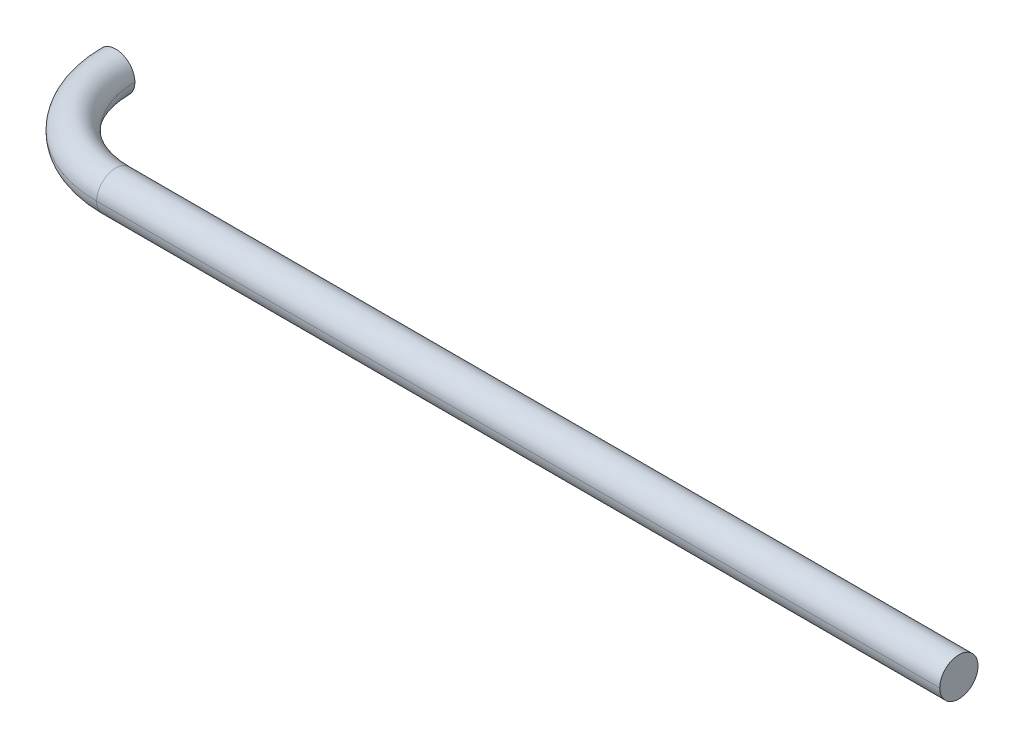
ISO-10303-21;
HEADER;
FILE_DESCRIPTION(('STEP AP214'),'2;1');
FILE_NAME('part.step','',(''),(''),'','','');
FILE_SCHEMA(('AUTOMOTIVE_DESIGN { 1 0 10303 214 1 1 1 1 }'));
ENDSEC;
DATA;
#1=APPLICATION_CONTEXT('core data for automotive mechanical design processes');
#2=APPLICATION_PROTOCOL_DEFINITION('international standard','automotive_design',2000,#1);
#3=PRODUCT_CONTEXT('',#1,'mechanical');
#4=PRODUCT('Part','Part','',(#3));
#5=PRODUCT_RELATED_PRODUCT_CATEGORY('part','',(#4));
#6=PRODUCT_DEFINITION_FORMATION('','',#4);
#7=PRODUCT_DEFINITION_CONTEXT('part definition',#1,'design');
#8=PRODUCT_DEFINITION('design','',#6,#7);
#9=PRODUCT_DEFINITION_SHAPE('','',#8);
#10=(LENGTH_UNIT() NAMED_UNIT(*) SI_UNIT(.MILLI.,.METRE.));
#11=(NAMED_UNIT(*) PLANE_ANGLE_UNIT() SI_UNIT($,.RADIAN.));
#12=(NAMED_UNIT(*) SI_UNIT($,.STERADIAN.) SOLID_ANGLE_UNIT());
#13=UNCERTAINTY_MEASURE_WITH_UNIT(LENGTH_MEASURE(1.E-05),#10,'distance_accuracy_value','');
#14=(GEOMETRIC_REPRESENTATION_CONTEXT(3) GLOBAL_UNCERTAINTY_ASSIGNED_CONTEXT((#13)) GLOBAL_UNIT_ASSIGNED_CONTEXT((#10,
#11,#12)) REPRESENTATION_CONTEXT('',''));
#15=CARTESIAN_POINT('',(0.,0.,0.));
#16=DIRECTION('',(0.,0.,1.));
#17=DIRECTION('',(1.,0.,0.));
#18=AXIS2_PLACEMENT_3D('',#15,#16,#17);
#19=CARTESIAN_POINT('',(3.4999999999986,0.,1.39727442019107E-12));
#20=DIRECTION('',(0.,1.,0.));
#21=DIRECTION('',(-1.,0.,-3.99221262911893E-13));
#22=AXIS2_PLACEMENT_3D('',#19,#20,#21);
#23=TOROIDAL_SURFACE('',#22,3.4999999999986,0.65);
#24=CARTESIAN_POINT('',(3.4999999999986,0.,1.39727442019107E-12));
#25=DIRECTION('',(0.,1.,0.));
#26=DIRECTION('',(0.,0.,1.));
#27=AXIS2_PLACEMENT_3D('',#24,#25,#26);
#28=CIRCLE('',#27,4.1499999999986);
#29=CARTESIAN_POINT('',(-0.65,0.,0.));
#30=VERTEX_POINT('',#29);
#31=CARTESIAN_POINT('',(3.49999999999748,0.,4.15));
#32=VERTEX_POINT('',#31);
#33=EDGE_CURVE('E71',#30,#32,#28,.T.);
#34=ORIENTED_EDGE('',*,*,#33,.F.);
#35=CARTESIAN_POINT('',(0.,0.,0.));
#36=DIRECTION('',(0.,0.,1.));
#37=DIRECTION('',(-1.,0.,0.));
#38=AXIS2_PLACEMENT_3D('',#35,#36,#37);
#39=CIRCLE('',#38,0.65);
#40=CARTESIAN_POINT('',(0.65,0.,0.));
#41=VERTEX_POINT('',#40);
#42=EDGE_CURVE('E28',#30,#41,#39,.T.);
#43=ORIENTED_EDGE('',*,*,#42,.T.);
#44=CARTESIAN_POINT('',(3.4999999999986,0.,1.39727442019107E-12));
#45=DIRECTION('',(0.,1.,0.));
#46=DIRECTION('',(0.,0.,1.));
#47=AXIS2_PLACEMENT_3D('',#44,#45,#46);
#48=CIRCLE('',#47,2.8499999999986);
#49=CARTESIAN_POINT('',(3.49999999999783,0.,2.85));
#50=VERTEX_POINT('',#49);
#51=EDGE_CURVE('E81',#41,#50,#48,.T.);
#52=ORIENTED_EDGE('',*,*,#51,.T.);
#53=CARTESIAN_POINT('',(3.49999999999765,0.,3.5));
#54=DIRECTION('',(1.,0.,2.71550944124062E-13));
#55=DIRECTION('',(-2.71550944124062E-13,0.,1.));
#56=AXIS2_PLACEMENT_3D('',#53,#54,#55);
#57=CIRCLE('',#56,0.65);
#58=EDGE_CURVE('E73',#32,#50,#57,.T.);
#59=ORIENTED_EDGE('',*,*,#58,.F.);
#60=EDGE_LOOP('',(#34,#43,#52,#59));
#61=FACE_BOUND('',#60,.T.);
#62=ADVANCED_FACE('F17',(#61),#23,.T.);
#63=CARTESIAN_POINT('',(3.49999999999765,0.,3.5));
#64=DIRECTION('',(1.,0.,0.));
#65=DIRECTION('',(0.,0.,1.));
#66=AXIS2_PLACEMENT_3D('',#63,#64,#65);
#67=CYLINDRICAL_SURFACE('',#66,0.65);
#68=DIRECTION('',(1.,0.,0.));
#69=VECTOR('',#68,1.);
#70=CARTESIAN_POINT('',(3.49999999999765,0.,2.85));
#71=LINE('',#70,#69);
#72=CARTESIAN_POINT('',(32.1389851691479,0.,2.85));
#73=VERTEX_POINT('',#72);
#74=EDGE_CURVE('E115',#50,#73,#71,.T.);
#75=ORIENTED_EDGE('',*,*,#74,.F.);
#76=CARTESIAN_POINT('',(3.49999999999765,0.,3.5));
#77=DIRECTION('',(1.,0.,2.71550944124062E-13));
#78=DIRECTION('',(-2.71550944124062E-13,0.,1.));
#79=AXIS2_PLACEMENT_3D('',#76,#77,#78);
#80=CIRCLE('',#79,0.65);
#81=EDGE_CURVE('E78',#50,#32,#80,.T.);
#82=ORIENTED_EDGE('',*,*,#81,.T.);
#83=DIRECTION('',(1.,0.,0.));
#84=VECTOR('',#83,1.);
#85=CARTESIAN_POINT('',(3.49999999999765,0.,4.15));
#86=LINE('',#85,#84);
#87=CARTESIAN_POINT('',(32.1389851691481,0.,4.15));
#88=VERTEX_POINT('',#87);
#89=EDGE_CURVE('E67',#32,#88,#86,.T.);
#90=ORIENTED_EDGE('',*,*,#89,.T.);
#91=CARTESIAN_POINT('',(32.138985169148,0.,3.5));
#92=DIRECTION('',(1.,0.,-1.28102656687518E-13));
#93=DIRECTION('',(1.28102656687518E-13,0.,1.));
#94=AXIS2_PLACEMENT_3D('',#91,#92,#93);
#95=CIRCLE('',#94,0.65);
#96=EDGE_CURVE('E11',#73,#88,#95,.T.);
#97=ORIENTED_EDGE('',*,*,#96,.F.);
#98=EDGE_LOOP('',(#75,#82,#90,#97));
#99=FACE_BOUND('',#98,.T.);
#100=ADVANCED_FACE('F178',(#99),#67,.T.);
#101=CARTESIAN_POINT('',(32.138985169148,0.,3.5));
#102=DIRECTION('',(1.,0.,-1.27491950812021E-13));
#103=DIRECTION('',(-1.27491950812021E-13,0.,-1.));
#104=AXIS2_PLACEMENT_3D('',#101,#102,#103);
#105=PLANE('',#104);
#106=CARTESIAN_POINT('',(32.138985169148,0.,3.5));
#107=DIRECTION('',(1.,0.,-1.28102656687518E-13));
#108=DIRECTION('',(1.28102656687518E-13,0.,1.));
#109=AXIS2_PLACEMENT_3D('',#106,#107,#108);
#110=CIRCLE('',#109,0.65);
#111=EDGE_CURVE('E122',#88,#73,#110,.T.);
#112=ORIENTED_EDGE('',*,*,#111,.T.);
#113=ORIENTED_EDGE('',*,*,#96,.T.);
#114=EDGE_LOOP('',(#112,#113));
#115=FACE_BOUND('',#114,.T.);
#116=ADVANCED_FACE('F19',(#115),#105,.T.);
#117=CARTESIAN_POINT('',(0.,0.,0.));
#118=DIRECTION('',(0.,0.,1.));
#119=DIRECTION('',(1.,0.,0.));
#120=AXIS2_PLACEMENT_3D('',#117,#118,#119);
#121=PLANE('',#120);
#122=CARTESIAN_POINT('',(0.,0.,0.));
#123=DIRECTION('',(0.,0.,1.));
#124=DIRECTION('',(-1.,0.,0.));
#125=AXIS2_PLACEMENT_3D('',#122,#123,#124);
#126=CIRCLE('',#125,0.65);
#127=EDGE_CURVE('E21',#41,#30,#126,.T.);
#128=ORIENTED_EDGE('',*,*,#127,.F.);
#129=ORIENTED_EDGE('',*,*,#42,.F.);
#130=EDGE_LOOP('',(#128,#129));
#131=FACE_BOUND('',#130,.T.);
#132=ADVANCED_FACE('F61',(#131),#121,.F.);
#133=CARTESIAN_POINT('',(3.49999999999765,0.,3.5));
#134=DIRECTION('',(1.,0.,0.));
#135=DIRECTION('',(0.,0.,1.));
#136=AXIS2_PLACEMENT_3D('',#133,#134,#135);
#137=CYLINDRICAL_SURFACE('',#136,0.65);
#138=ORIENTED_EDGE('',*,*,#58,.T.);
#139=ORIENTED_EDGE('',*,*,#74,.T.);
#140=ORIENTED_EDGE('',*,*,#111,.F.);
#141=ORIENTED_EDGE('',*,*,#89,.F.);
#142=EDGE_LOOP('',(#138,#139,#140,#141));
#143=FACE_BOUND('',#142,.T.);
#144=ADVANCED_FACE('F146',(#143),#137,.T.);
#145=CARTESIAN_POINT('',(3.4999999999986,0.,1.39727442019107E-12));
#146=DIRECTION('',(0.,1.,0.));
#147=DIRECTION('',(-1.,0.,-3.99221262911893E-13));
#148=AXIS2_PLACEMENT_3D('',#145,#146,#147);
#149=TOROIDAL_SURFACE('',#148,3.4999999999986,0.65);
#150=ORIENTED_EDGE('',*,*,#127,.T.);
#151=ORIENTED_EDGE('',*,*,#33,.T.);
#152=ORIENTED_EDGE('',*,*,#81,.F.);
#153=ORIENTED_EDGE('',*,*,#51,.F.);
#154=EDGE_LOOP('',(#150,#151,#152,#153));
#155=FACE_BOUND('',#154,.T.);
#156=ADVANCED_FACE('F80',(#155),#149,.T.);
#157=CLOSED_SHELL('',(#62,#100,#116,#132,#144,#156));
#158=MANIFOLD_SOLID_BREP('B1',#157);
#159=ADVANCED_BREP_SHAPE_REPRESENTATION('',(#18,#158),#14);
#160=SHAPE_DEFINITION_REPRESENTATION(#9,#159);
ENDSEC;
END-ISO-10303-21;
